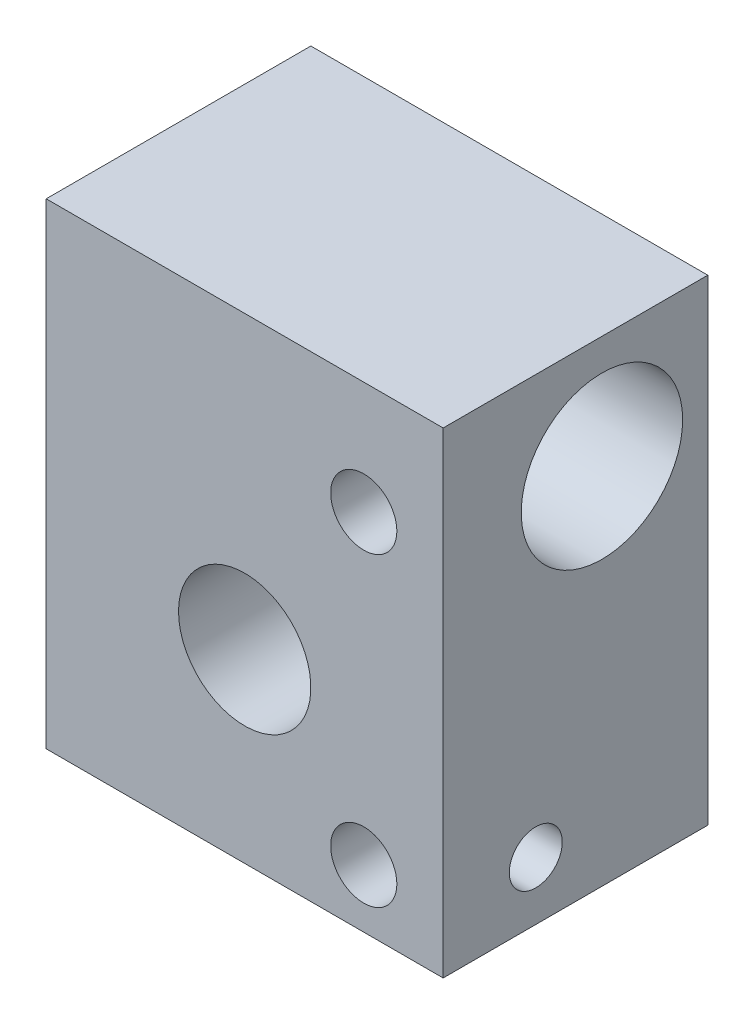
ISO-10303-21;
HEADER;
FILE_DESCRIPTION(('STEP AP214'),'2;1');
FILE_NAME('part.step','',(''),(''),'','','');
FILE_SCHEMA(('AUTOMOTIVE_DESIGN { 1 0 10303 214 1 1 1 1 }'));
ENDSEC;
DATA;
#1=APPLICATION_CONTEXT('core data for automotive mechanical design processes');
#2=APPLICATION_PROTOCOL_DEFINITION('international standard','automotive_design',2000,#1);
#3=PRODUCT_CONTEXT('',#1,'mechanical');
#4=PRODUCT('Part','Part','',(#3));
#5=PRODUCT_RELATED_PRODUCT_CATEGORY('part','',(#4));
#6=PRODUCT_DEFINITION_FORMATION('','',#4);
#7=PRODUCT_DEFINITION_CONTEXT('part definition',#1,'design');
#8=PRODUCT_DEFINITION('design','',#6,#7);
#9=PRODUCT_DEFINITION_SHAPE('','',#8);
#10=(LENGTH_UNIT() NAMED_UNIT(*) SI_UNIT(.MILLI.,.METRE.));
#11=(NAMED_UNIT(*) PLANE_ANGLE_UNIT() SI_UNIT($,.RADIAN.));
#12=(NAMED_UNIT(*) SI_UNIT($,.STERADIAN.) SOLID_ANGLE_UNIT());
#13=UNCERTAINTY_MEASURE_WITH_UNIT(LENGTH_MEASURE(1.E-05),#10,'distance_accuracy_value','');
#14=(GEOMETRIC_REPRESENTATION_CONTEXT(3) GLOBAL_UNCERTAINTY_ASSIGNED_CONTEXT((#13)) GLOBAL_UNIT_ASSIGNED_CONTEXT((#10,
#11,#12)) REPRESENTATION_CONTEXT('',''));
#15=CARTESIAN_POINT('',(0.,0.,0.));
#16=DIRECTION('',(0.,0.,1.));
#17=DIRECTION('',(1.,0.,0.));
#18=AXIS2_PLACEMENT_3D('',#15,#16,#17);
#19=CARTESIAN_POINT('',(7.5,-9.,10.));
#20=DIRECTION('',(-1.,0.,0.));
#21=DIRECTION('',(0.,0.,1.));
#22=AXIS2_PLACEMENT_3D('',#19,#20,#21);
#23=PLANE('',#22);
#24=CARTESIAN_POINT('',(7.5,-6.8,6.5));
#25=DIRECTION('',(1.,0.,0.));
#26=DIRECTION('',(0.,0.,-1.));
#27=AXIS2_PLACEMENT_3D('',#24,#25,#26);
#28=CIRCLE('',#27,0.999999999999998);
#29=CARTESIAN_POINT('',(7.5,-6.8,5.5));
#30=VERTEX_POINT('',#29);
#31=EDGE_CURVE('E108',#30,#30,#28,.T.);
#32=ORIENTED_EDGE('',*,*,#31,.F.);
#33=EDGE_LOOP('',(#32));
#34=FACE_BOUND('',#33,.T.);
#35=CARTESIAN_POINT('',(7.5,4.75,4.));
#36=DIRECTION('',(1.,0.,0.));
#37=DIRECTION('',(0.,0.,-1.));
#38=AXIS2_PLACEMENT_3D('',#35,#36,#37);
#39=CIRCLE('',#38,3.05);
#40=CARTESIAN_POINT('',(7.5,4.75,0.950000000000001));
#41=VERTEX_POINT('',#40);
#42=EDGE_CURVE('E229',#41,#41,#39,.T.);
#43=ORIENTED_EDGE('',*,*,#42,.F.);
#44=EDGE_LOOP('',(#43));
#45=FACE_BOUND('',#44,.T.);
#46=DIRECTION('',(0.,1.,0.));
#47=VECTOR('',#46,1.);
#48=CARTESIAN_POINT('',(7.5,-9.,0.));
#49=LINE('',#48,#47);
#50=CARTESIAN_POINT('',(7.5,-9.,0.));
#51=VERTEX_POINT('',#50);
#52=CARTESIAN_POINT('',(7.5,9.,0.));
#53=VERTEX_POINT('',#52);
#54=EDGE_CURVE('E190',#51,#53,#49,.T.);
#55=ORIENTED_EDGE('',*,*,#54,.T.);
#56=DIRECTION('',(0.,0.,-1.));
#57=VECTOR('',#56,1.);
#58=CARTESIAN_POINT('',(7.5,9.,10.));
#59=LINE('',#58,#57);
#60=CARTESIAN_POINT('',(7.5,9.,10.));
#61=VERTEX_POINT('',#60);
#62=EDGE_CURVE('E136',#61,#53,#59,.T.);
#63=ORIENTED_EDGE('',*,*,#62,.F.);
#64=DIRECTION('',(0.,1.,0.));
#65=VECTOR('',#64,1.);
#66=CARTESIAN_POINT('',(7.5,-9.,10.));
#67=LINE('',#66,#65);
#68=CARTESIAN_POINT('',(7.5,-9.,10.));
#69=VERTEX_POINT('',#68);
#70=EDGE_CURVE('E201',#69,#61,#67,.T.);
#71=ORIENTED_EDGE('',*,*,#70,.F.);
#72=DIRECTION('',(0.,0.,-1.));
#73=VECTOR('',#72,1.);
#74=CARTESIAN_POINT('',(7.5,-9.,10.));
#75=LINE('',#74,#73);
#76=EDGE_CURVE('E205',#69,#51,#75,.T.);
#77=ORIENTED_EDGE('',*,*,#76,.T.);
#78=EDGE_LOOP('',(#55,#63,#71,#77));
#79=FACE_BOUND('',#78,.T.);
#80=ADVANCED_FACE('F38',(#34,#45,#79),#23,.F.);
#81=CARTESIAN_POINT('',(-7.5,9.,10.));
#82=DIRECTION('',(0.,-1.,0.));
#83=DIRECTION('',(0.,0.,-1.));
#84=AXIS2_PLACEMENT_3D('',#81,#82,#83);
#85=PLANE('',#84);
#86=DIRECTION('',(-1.,0.,0.));
#87=VECTOR('',#86,1.);
#88=CARTESIAN_POINT('',(-7.5,9.,0.));
#89=LINE('',#88,#87);
#90=CARTESIAN_POINT('',(-7.5,9.,0.));
#91=VERTEX_POINT('',#90);
#92=EDGE_CURVE('E180',#53,#91,#89,.T.);
#93=ORIENTED_EDGE('',*,*,#92,.T.);
#94=DIRECTION('',(0.,0.,-1.));
#95=VECTOR('',#94,1.);
#96=CARTESIAN_POINT('',(-7.5,9.,10.));
#97=LINE('',#96,#95);
#98=CARTESIAN_POINT('',(-7.5,9.,10.));
#99=VERTEX_POINT('',#98);
#100=EDGE_CURVE('E182',#99,#91,#97,.T.);
#101=ORIENTED_EDGE('',*,*,#100,.F.);
#102=DIRECTION('',(-1.,0.,0.));
#103=VECTOR('',#102,1.);
#104=CARTESIAN_POINT('',(-7.5,9.,10.));
#105=LINE('',#104,#103);
#106=EDGE_CURVE('E215',#61,#99,#105,.T.);
#107=ORIENTED_EDGE('',*,*,#106,.F.);
#108=ORIENTED_EDGE('',*,*,#62,.T.);
#109=EDGE_LOOP('',(#93,#101,#107,#108));
#110=FACE_BOUND('',#109,.T.);
#111=ADVANCED_FACE('F170',(#110),#85,.F.);
#112=CARTESIAN_POINT('',(-7.5,-9.,10.));
#113=DIRECTION('',(1.,0.,0.));
#114=DIRECTION('',(0.,0.,-1.));
#115=AXIS2_PLACEMENT_3D('',#112,#113,#114);
#116=PLANE('',#115);
#117=CARTESIAN_POINT('',(-7.5,4.75,4.));
#118=DIRECTION('',(1.,0.,0.));
#119=DIRECTION('',(0.,0.,-1.));
#120=AXIS2_PLACEMENT_3D('',#117,#118,#119);
#121=CIRCLE('',#120,3.05);
#122=CARTESIAN_POINT('',(-7.5,4.75,0.950000000000001));
#123=VERTEX_POINT('',#122);
#124=EDGE_CURVE('E226',#123,#123,#121,.T.);
#125=ORIENTED_EDGE('',*,*,#124,.T.);
#126=EDGE_LOOP('',(#125));
#127=FACE_BOUND('',#126,.T.);
#128=DIRECTION('',(0.,-1.,0.));
#129=VECTOR('',#128,1.);
#130=CARTESIAN_POINT('',(-7.5,-9.,0.));
#131=LINE('',#130,#129);
#132=CARTESIAN_POINT('',(-7.5,-9.,0.));
#133=VERTEX_POINT('',#132);
#134=EDGE_CURVE('E189',#91,#133,#131,.T.);
#135=ORIENTED_EDGE('',*,*,#134,.T.);
#136=DIRECTION('',(0.,0.,-1.));
#137=VECTOR('',#136,1.);
#138=CARTESIAN_POINT('',(-7.5,-9.,10.));
#139=LINE('',#138,#137);
#140=CARTESIAN_POINT('',(-7.5,-9.,10.));
#141=VERTEX_POINT('',#140);
#142=EDGE_CURVE('E196',#141,#133,#139,.T.);
#143=ORIENTED_EDGE('',*,*,#142,.F.);
#144=DIRECTION('',(0.,-1.,0.));
#145=VECTOR('',#144,1.);
#146=CARTESIAN_POINT('',(-7.5,-9.,10.));
#147=LINE('',#146,#145);
#148=EDGE_CURVE('E195',#99,#141,#147,.T.);
#149=ORIENTED_EDGE('',*,*,#148,.F.);
#150=ORIENTED_EDGE('',*,*,#100,.T.);
#151=EDGE_LOOP('',(#135,#143,#149,#150));
#152=FACE_BOUND('',#151,.T.);
#153=ADVANCED_FACE('F167',(#127,#152),#116,.F.);
#154=CARTESIAN_POINT('',(-7.5,-9.,10.));
#155=DIRECTION('',(0.,1.,0.));
#156=DIRECTION('',(0.,0.,1.));
#157=AXIS2_PLACEMENT_3D('',#154,#155,#156);
#158=PLANE('',#157);
#159=DIRECTION('',(1.,0.,0.));
#160=VECTOR('',#159,1.);
#161=CARTESIAN_POINT('',(-7.5,-9.,0.));
#162=LINE('',#161,#160);
#163=EDGE_CURVE('E199',#133,#51,#162,.T.);
#164=ORIENTED_EDGE('',*,*,#163,.T.);
#165=ORIENTED_EDGE('',*,*,#76,.F.);
#166=DIRECTION('',(1.,0.,0.));
#167=VECTOR('',#166,1.);
#168=CARTESIAN_POINT('',(-7.5,-9.,10.));
#169=LINE('',#168,#167);
#170=EDGE_CURVE('E208',#141,#69,#169,.T.);
#171=ORIENTED_EDGE('',*,*,#170,.F.);
#172=ORIENTED_EDGE('',*,*,#142,.T.);
#173=EDGE_LOOP('',(#164,#165,#171,#172));
#174=FACE_BOUND('',#173,.T.);
#175=ADVANCED_FACE('F160',(#174),#158,.F.);
#176=CARTESIAN_POINT('',(0.,0.,10.));
#177=DIRECTION('',(0.,0.,-1.));
#178=DIRECTION('',(-1.,0.,0.));
#179=AXIS2_PLACEMENT_3D('',#176,#177,#178);
#180=PLANE('',#179);
#181=CARTESIAN_POINT('',(4.5,4.75,10.));
#182=DIRECTION('',(0.,0.,1.));
#183=DIRECTION('',(1.,0.,0.));
#184=AXIS2_PLACEMENT_3D('',#181,#182,#183);
#185=CIRCLE('',#184,1.24999999999999);
#186=CARTESIAN_POINT('',(5.74999999999999,4.75,10.));
#187=VERTEX_POINT('',#186);
#188=EDGE_CURVE('E241',#187,#187,#185,.T.);
#189=ORIENTED_EDGE('',*,*,#188,.F.);
#190=EDGE_LOOP('',(#189));
#191=FACE_BOUND('',#190,.T.);
#192=CARTESIAN_POINT('',(4.5,-6.8,10.));
#193=DIRECTION('',(0.,0.,1.));
#194=DIRECTION('',(1.,0.,0.));
#195=AXIS2_PLACEMENT_3D('',#192,#193,#194);
#196=CIRCLE('',#195,1.24999999999999);
#197=CARTESIAN_POINT('',(5.74999999999999,-6.8,10.));
#198=VERTEX_POINT('',#197);
#199=EDGE_CURVE('E239',#198,#198,#196,.T.);
#200=ORIENTED_EDGE('',*,*,#199,.F.);
#201=EDGE_LOOP('',(#200));
#202=FACE_BOUND('',#201,.T.);
#203=CARTESIAN_POINT('',(0.,-2.,10.));
#204=DIRECTION('',(0.,0.,-1.));
#205=DIRECTION('',(-1.,0.,0.));
#206=AXIS2_PLACEMENT_3D('',#203,#204,#205);
#207=CIRCLE('',#206,2.5);
#208=CARTESIAN_POINT('',(-2.5,-2.,10.));
#209=VERTEX_POINT('',#208);
#210=EDGE_CURVE('E218',#209,#209,#207,.T.);
#211=ORIENTED_EDGE('',*,*,#210,.T.);
#212=EDGE_LOOP('',(#211));
#213=FACE_BOUND('',#212,.T.);
#214=ORIENTED_EDGE('',*,*,#70,.T.);
#215=ORIENTED_EDGE('',*,*,#106,.T.);
#216=ORIENTED_EDGE('',*,*,#148,.T.);
#217=ORIENTED_EDGE('',*,*,#170,.T.);
#218=EDGE_LOOP('',(#214,#215,#216,#217));
#219=FACE_BOUND('',#218,.T.);
#220=ADVANCED_FACE('F157',(#191,#202,#213,#219),#180,.F.);
#221=CARTESIAN_POINT('',(0.,0.,0.));
#222=DIRECTION('',(0.,0.,-1.));
#223=DIRECTION('',(-1.,0.,0.));
#224=AXIS2_PLACEMENT_3D('',#221,#222,#223);
#225=PLANE('',#224);
#226=CARTESIAN_POINT('',(0.,-2.,0.));
#227=DIRECTION('',(0.,0.,-1.));
#228=DIRECTION('',(-1.,0.,0.));
#229=AXIS2_PLACEMENT_3D('',#226,#227,#228);
#230=CIRCLE('',#229,2.5);
#231=CARTESIAN_POINT('',(-2.5,-2.,0.));
#232=VERTEX_POINT('',#231);
#233=EDGE_CURVE('E221',#232,#232,#230,.T.);
#234=ORIENTED_EDGE('',*,*,#233,.F.);
#235=EDGE_LOOP('',(#234));
#236=FACE_BOUND('',#235,.T.);
#237=ORIENTED_EDGE('',*,*,#54,.F.);
#238=ORIENTED_EDGE('',*,*,#163,.F.);
#239=ORIENTED_EDGE('',*,*,#134,.F.);
#240=ORIENTED_EDGE('',*,*,#92,.F.);
#241=EDGE_LOOP('',(#237,#238,#239,#240));
#242=FACE_BOUND('',#241,.T.);
#243=ADVANCED_FACE('F155',(#236,#242),#225,.T.);
#244=CARTESIAN_POINT('',(0.,-2.,10.));
#245=DIRECTION('',(0.,0.,-1.));
#246=DIRECTION('',(-1.,0.,0.));
#247=AXIS2_PLACEMENT_3D('',#244,#245,#246);
#248=CYLINDRICAL_SURFACE('',#247,2.5);
#249=ORIENTED_EDGE('',*,*,#210,.F.);
#250=EDGE_LOOP('',(#249));
#251=FACE_BOUND('',#250,.T.);
#252=ORIENTED_EDGE('',*,*,#233,.T.);
#253=EDGE_LOOP('',(#252));
#254=FACE_BOUND('',#253,.T.);
#255=ADVANCED_FACE('F151',(#251,#254),#248,.F.);
#256=CARTESIAN_POINT('',(-7.5,4.75,4.));
#257=DIRECTION('',(1.,0.,0.));
#258=DIRECTION('',(0.,0.,-1.));
#259=AXIS2_PLACEMENT_3D('',#256,#257,#258);
#260=CYLINDRICAL_SURFACE('',#259,3.05);
#261=CARTESIAN_POINT('',(5.74999999999999,4.75,7.05));
#262=CARTESIAN_POINT('',(5.74999317358084,4.81705105449435,7.0499949013604));
#263=CARTESIAN_POINT('',(5.7445728904159,4.88421220939516,7.04776316601173));
#264=CARTESIAN_POINT('',(5.7230821427269,5.01663531512961,7.03905220749816));
#265=CARTESIAN_POINT('',(5.7069833965083,5.08189174087961,7.0325617055695));
#266=CARTESIAN_POINT('',(5.66482596800735,5.20837429284752,7.01603149034563));
#267=CARTESIAN_POINT('',(5.63880056530878,5.2696130929358,7.00600364451595));
#268=CARTESIAN_POINT('',(5.57766372514542,5.38679775394015,6.98337979201622));
#269=CARTESIAN_POINT('',(5.54255520538643,5.44274530666015,6.97078461030852));
#270=CARTESIAN_POINT('',(5.46243359833868,5.55058268229026,6.94360272183732));
#271=CARTESIAN_POINT('',(5.41704813784625,5.60217961883631,6.92895218720805));
#272=CARTESIAN_POINT('',(5.31844769395315,5.69727980579278,6.8995935820288));
#273=CARTESIAN_POINT('',(5.26522873562099,5.74077892161812,6.88488548598071));
#274=CARTESIAN_POINT('',(5.1494220879687,5.82047635819198,6.85630174305004));
#275=CARTESIAN_POINT('',(5.08651058665788,5.85623272255294,6.84249824263373));
#276=CARTESIAN_POINT('',(4.95491722684178,5.91652509902148,6.81829427065235));
#277=CARTESIAN_POINT('',(4.88623826542879,5.9410667050528,6.80789210323986));
#278=CARTESIAN_POINT('',(4.74842884283273,5.977033698322,6.79235707938262));
#279=CARTESIAN_POINT('',(4.67947149284317,5.98902161527503,6.78699943260884));
#280=CARTESIAN_POINT('',(4.54033187566907,6.00129693566521,6.78151145539133));
#281=CARTESIAN_POINT('',(4.47015027248522,6.00159049579919,6.78137837438494));
#282=CARTESIAN_POINT('',(4.33607409840986,5.99089353762405,6.78616368996563));
#283=CARTESIAN_POINT('',(4.27209740726591,5.98073314256808,6.79071047916049));
#284=CARTESIAN_POINT('',(4.14685271703793,5.95080567936669,6.80371701324258));
#285=CARTESIAN_POINT('',(4.08558521945647,5.93103684064336,6.81217747930138));
#286=CARTESIAN_POINT('',(3.96597856734735,5.88207159424284,6.83224715740189));
#287=CARTESIAN_POINT('',(3.90772757534972,5.85268647565431,6.84391858333761));
#288=CARTESIAN_POINT('',(3.79676189319712,5.78545581744839,6.8690795378448));
#289=CARTESIAN_POINT('',(3.74404935655718,5.7476070046597,6.88256976900067));
#290=CARTESIAN_POINT('',(3.64113506271575,5.66089979031177,6.91118669367846));
#291=CARTESIAN_POINT('',(3.59148817119212,5.61139546177047,6.92635714795841));
#292=CARTESIAN_POINT('',(3.50101833818234,5.50460843164101,6.95569448523891));
#293=CARTESIAN_POINT('',(3.46019733238115,5.44732402821036,6.96986114763168));
#294=CARTESIAN_POINT('',(3.38776019476994,5.32496342854657,6.99598214323011));
#295=CARTESIAN_POINT('',(3.35636271935724,5.25974527572702,7.00788187819974));
#296=CARTESIAN_POINT('',(3.30517803112997,5.12434088842293,7.02771185130719));
#297=CARTESIAN_POINT('',(3.28538461664024,5.05415733016857,7.03564420943661));
#298=CARTESIAN_POINT('',(3.25911499785756,4.91545720041041,7.04625363825052));
#299=CARTESIAN_POINT('',(3.25189372784432,4.84710415103708,7.04922426910946));
#300=CARTESIAN_POINT('',(3.24876092149755,4.71010441371817,7.0505074612745));
#301=CARTESIAN_POINT('',(3.25284627086616,4.64145781182913,7.04882130524732));
#302=CARTESIAN_POINT('',(3.27167121733155,4.50926209998629,7.04117156509262));
#303=CARTESIAN_POINT('',(3.28589367478943,4.44562598291882,7.03541570476584));
#304=CARTESIAN_POINT('',(3.32387605471634,4.32170816248345,7.02042451329165));
#305=CARTESIAN_POINT('',(3.34763719121059,4.26142688721188,7.01118873925112));
#306=CARTESIAN_POINT('',(3.40479928404273,4.14383011012163,6.98977295322551));
#307=CARTESIAN_POINT('',(3.43847544195124,4.08666382302296,6.97751077732146));
#308=CARTESIAN_POINT('',(3.51420811639302,3.97859041874229,6.95135965585715));
#309=CARTESIAN_POINT('',(3.55626807827196,3.92768588879936,6.93747004246777));
#310=CARTESIAN_POINT('',(3.65098440399942,3.82987991098666,6.9083776173988));
#311=CARTESIAN_POINT('',(3.70417275944046,3.78349954211682,6.89315046142814));
#312=CARTESIAN_POINT('',(3.81783195761042,3.70018452435906,6.86397295744693));
#313=CARTESIAN_POINT('',(3.87830425548019,3.66325176747518,6.85002286554325));
#314=CARTESIAN_POINT('',(4.00591935720062,3.59955272757804,6.82491824303052));
#315=CARTESIAN_POINT('',(4.0731350035576,3.57291696039833,6.8138001745101));
#316=CARTESIAN_POINT('',(4.21169404128461,3.53156002386075,6.79614362783963));
#317=CARTESIAN_POINT('',(4.28303413036749,3.51682946022231,6.78960153937764));
#318=CARTESIAN_POINT('',(4.42205571719578,3.50061997017984,6.78237686582237));
#319=CARTESIAN_POINT('',(4.48961071540186,3.49823064874135,6.78129189039514));
#320=CARTESIAN_POINT('',(4.62411541510115,3.50435741732201,6.78404131006805));
#321=CARTESIAN_POINT('',(4.6910652011546,3.51287195937366,6.7878750068888));
#322=CARTESIAN_POINT('',(4.8194595845332,3.53980857539514,6.79966724973414));
#323=CARTESIAN_POINT('',(4.88101694579431,3.55778270632242,6.80743875303861));
#324=CARTESIAN_POINT('',(5.00026093044537,3.60269826055876,6.82609039777681));
#325=CARTESIAN_POINT('',(5.0579464682445,3.62964218632339,6.83697140660187));
#326=CARTESIAN_POINT('',(5.17152052867124,3.69356546820026,6.86141244323642));
#327=CARTESIAN_POINT('',(5.22710231558399,3.73104304994741,6.87509264152988));
#328=CARTESIAN_POINT('',(5.33147333634056,3.81425954659735,6.90324259102355));
#329=CARTESIAN_POINT('',(5.38026033074679,3.8600011738197,6.91771260035406));
#330=CARTESIAN_POINT('',(5.47314082024466,3.96222488066987,6.94701985281455));
#331=CARTESIAN_POINT('',(5.51667265144533,4.0192324065468,6.961812751821));
#332=CARTESIAN_POINT('',(5.59357367951555,4.14029737005191,6.98908126299053));
#333=CARTESIAN_POINT('',(5.6269382146159,4.20435802331352,7.00155581115557));
#334=CARTESIAN_POINT('',(5.68180811191665,4.33663629870453,7.02258806460315));
#335=CARTESIAN_POINT('',(5.70351052450805,4.40476171520484,7.03121040731175));
#336=CARTESIAN_POINT('',(5.73495872650017,4.54399616753341,7.04383134859934));
#337=CARTESIAN_POINT('',(5.74474216568277,4.61509507070934,7.04784450441534));
#338=CARTESIAN_POINT('',(5.74946289651355,4.70760124338892,7.04978053015449));
#339=CARTESIAN_POINT('',(5.75000215885384,4.72879511590617,7.05000161244387));
#340=CARTESIAN_POINT('',(5.74999999999999,4.75,7.05));
#341=B_SPLINE_CURVE_WITH_KNOTS('',3,(#261,#262,#263,#264,#265,#266,#267,#268,#269,#270,#271,
#272,#273,#274,#275,#276,#277,#278,#279,#280,#281,#282,#283,#284,#285,#286,#287,#288,#289,#290,
#291,#292,#293,#294,#295,#296,#297,#298,#299,#300,#301,#302,#303,#304,#305,#306,#307,#308,#309,
#310,#311,#312,#313,#314,#315,#316,#317,#318,#319,#320,#321,#322,#323,#324,#325,#326,#327,#328,
#329,#330,#331,#332,#333,#334,#335,#336,#337,#338,#339,#340),.UNSPECIFIED.,.T.,.F.,(4,2,2,2,2,2,
2,2,2,2,2,2,2,2,2,2,2,2,2,2,2,2,2,2,2,2,2,2,2,2,2,2,2,2,2,2,2,2,2,4),(0.,0.201094311180327,
0.402723354574274,0.60368228554281,0.804576743863707,1.01444492091329,1.22441996030868,
1.44431409976959,1.66409843594336,1.87354721803841,2.08288573073389,2.27679448285735,
2.47073898070664,2.66874390795883,2.86682554265503,3.08105274490332,3.29532688370776,
3.51424468844056,3.73304538781654,3.93837132545348,4.14364071369572,4.33912550528581,
4.53463518488672,4.73618655641969,4.93782092740471,5.15341391236424,5.36905003881043,
5.58733616568886,5.80544987646513,6.00721727204662,6.20895602688514,6.40190297186301,
6.59490379169176,6.79928960640031,7.00374262427848,7.22240178249367,7.44116104698124,
7.65609749208749,7.87035321839582,7.93394925864703),.UNSPECIFIED.);
#342=CARTESIAN_POINT('',(5.74999999999999,4.75,7.05));
#343=VERTEX_POINT('',#342);
#344=EDGE_CURVE('E137',#343,#343,#341,.T.);
#345=ORIENTED_EDGE('',*,*,#344,.T.);
#346=EDGE_LOOP('',(#345));
#347=FACE_BOUND('',#346,.T.);
#348=ORIENTED_EDGE('',*,*,#124,.F.);
#349=EDGE_LOOP('',(#348));
#350=FACE_BOUND('',#349,.T.);
#351=ORIENTED_EDGE('',*,*,#42,.T.);
#352=EDGE_LOOP('',(#351));
#353=FACE_BOUND('',#352,.T.);
#354=ADVANCED_FACE('F145',(#347,#350,#353),#260,.F.);
#355=CARTESIAN_POINT('',(4.5,-6.8,6.));
#356=DIRECTION('',(0.,0.,1.));
#357=DIRECTION('',(1.,0.,0.));
#358=AXIS2_PLACEMENT_3D('',#355,#356,#357);
#359=CONICAL_SURFACE('',#358,1.25,1.02974425867665);
#360=CARTESIAN_POINT('',(4.5,-6.8,5.24892422621555));
#361=VERTEX_POINT('',#360);
#362=VERTEX_LOOP('',#361);
#363=FACE_BOUND('',#362,.T.);
#364=CARTESIAN_POINT('',(4.5,-6.8,6.));
#365=DIRECTION('',(0.,0.,1.));
#366=DIRECTION('',(1.,0.,0.));
#367=AXIS2_PLACEMENT_3D('',#364,#365,#366);
#368=CIRCLE('',#367,1.25);
#369=CARTESIAN_POINT('',(3.598612181134,-7.66602540378443,6.));
#370=VERTEX_POINT('',#369);
#371=CARTESIAN_POINT('',(5.40138781886869,-7.66602540378681,6.00000000000196));
#372=VERTEX_POINT('',#371);
#373=EDGE_CURVE('E238',#370,#372,#368,.T.);
#374=ORIENTED_EDGE('',*,*,#373,.T.);
#375=CARTESIAN_POINT('',(5.49028641707355,-7.69312930754734,6.0502));
#376=CARTESIAN_POINT('',(5.4620540291597,-7.68516229364402,6.03439446403427));
#377=CARTESIAN_POINT('',(5.43397441822092,-7.67667040293627,6.01856440625544));
#378=CARTESIAN_POINT('',(5.37820933805071,-7.65846567832842,5.98679857880335));
#379=CARTESIAN_POINT('',(5.35052460000254,-7.64875084220868,5.97086267732073));
#380=CARTESIAN_POINT('',(5.29534164443274,-7.62780610981277,5.93865263805377));
#381=CARTESIAN_POINT('',(5.26785172041543,-7.6165565790724,5.92237691803523));
#382=CARTESIAN_POINT('',(5.21372068820972,-7.59240944996764,5.88967177107602));
#383=CARTESIAN_POINT('',(5.18707899740181,-7.5795130147024,5.87324246012328));
#384=CARTESIAN_POINT('',(5.13220243909832,-7.55021227801001,5.83836852135706));
#385=CARTESIAN_POINT('',(5.10410431543777,-7.53357989189848,5.8198971567474));
#386=CARTESIAN_POINT('',(5.05034517125699,-7.49710879666876,5.78255861572174));
#387=CARTESIAN_POINT('',(5.02467984624535,-7.47727592504741,5.76369221334503));
#388=CARTESIAN_POINT('',(4.98483989175455,-7.43999201796968,5.73135380836441));
#389=CARTESIAN_POINT('',(4.96954941989286,-7.4236625107789,5.71799347162254));
#390=CARTESIAN_POINT('',(4.94218478884379,-7.38857975994309,5.6912618305678));
#391=CARTESIAN_POINT('',(4.93009685493828,-7.36983742938766,5.67789082979815));
#392=CARTESIAN_POINT('',(4.91016740799821,-7.329590146974,5.65140304199133));
#393=CARTESIAN_POINT('',(4.90238168548031,-7.3080531773224,5.63829162851512));
#394=CARTESIAN_POINT('',(4.89169708291768,-7.26309379111954,5.61331666161574));
#395=CARTESIAN_POINT('',(4.88881009238113,-7.23966693149489,5.60145620952708));
#396=CARTESIAN_POINT('',(4.88623771053257,-7.18102854252964,5.57464593497841));
#397=CARTESIAN_POINT('',(4.8886037228914,-7.14530002689939,5.56074189203022));
#398=CARTESIAN_POINT('',(4.89581292295022,-7.07266926803107,5.53712400838137));
#399=CARTESIAN_POINT('',(4.90066989969421,-7.03576157518701,5.52743405299092));
#400=CARTESIAN_POINT('',(4.91006860539325,-6.95380542606474,5.51086100553405));
#401=CARTESIAN_POINT('',(4.91437678220478,-6.90853802728334,5.50485597158092));
#402=CARTESIAN_POINT('',(4.9184748067492,-6.81754799344687,5.49912238604378));
#403=CARTESIAN_POINT('',(4.91828328292789,-6.77182801826922,5.49936795774198));
#404=CARTESIAN_POINT('',(4.91341881342609,-6.67863261058294,5.50622854677725));
#405=CARTESIAN_POINT('',(4.90849830019974,-6.63120016203335,5.51319551359828));
#406=CARTESIAN_POINT('',(4.8974167784806,-6.53776947303589,5.53380349357297));
#407=CARTESIAN_POINT('',(4.89125185371857,-6.4917763035517,5.54746577626934));
#408=CARTESIAN_POINT('',(4.88715963497418,-6.42244524242514,5.57365031385066));
#409=CARTESIAN_POINT('',(4.88674774685179,-6.39841640858867,5.58380701297793));
#410=CARTESIAN_POINT('',(4.88976593975288,-6.3515349652331,5.60582909571334));
#411=CARTESIAN_POINT('',(4.89316735273016,-6.32867491195563,5.61768115280812));
#412=CARTESIAN_POINT('',(4.90481955461782,-6.28460383870021,5.642669092288));
#413=CARTESIAN_POINT('',(4.91312257269359,-6.26341340810177,5.65581751190304));
#414=CARTESIAN_POINT('',(4.93411194219538,-6.22351706477168,5.68253382279197));
#415=CARTESIAN_POINT('',(4.94682115498955,-6.20482482880032,5.69610355897556));
#416=CARTESIAN_POINT('',(4.98149614630583,-6.16232995685965,5.72903491275924));
#417=CARTESIAN_POINT('',(5.00508221426013,-6.13985006830772,5.74834355388397));
#418=CARTESIAN_POINT('',(5.05581374943648,-6.09868488061901,5.78659230699454));
#419=CARTESIAN_POINT('',(5.08298397356535,-6.08002851866166,5.80552869364956));
#420=CARTESIAN_POINT('',(5.14072146790836,-6.04479770679221,5.84396632214518));
#421=CARTESIAN_POINT('',(5.1713904277386,-6.02837263772575,5.86344892060987));
#422=CARTESIAN_POINT('',(5.23412643971758,-5.99799989181846,5.90217002760717));
#423=CARTESIAN_POINT('',(5.26619554023356,-5.98405600718381,5.92140812147574));
#424=CARTESIAN_POINT('',(5.3300143351173,-5.95868810757523,5.95899211536545));
#425=CARTESIAN_POINT('',(5.36173093611331,-5.94718922450714,5.97734442596747));
#426=CARTESIAN_POINT('',(5.4256642289682,-5.92585951930255,6.0138744249624));
#427=CARTESIAN_POINT('',(5.45787881496915,-5.91602307251018,6.03205249756596));
#428=CARTESIAN_POINT('',(5.49028641707356,-5.90687069245265,6.05019999999999));
#429=B_SPLINE_CURVE_WITH_KNOTS('',3,(#375,#376,#377,#378,#379,#380,#381,#382,#383,#384,#385,
#386,#387,#388,#389,#390,#391,#392,#393,#394,#395,#396,#397,#398,#399,#400,#401,#402,#403,#404,
#405,#406,#407,#408,#409,#410,#411,#412,#413,#414,#415,#416,#417,#418,#419,#420,#421,#422,#423,
#424,#425,#426,#427,#428),.UNSPECIFIED.,.F.,.F.,(4,2,2,2,2,2,2,2,2,2,2,2,2,2,2,2,2,2,2,2,2,2,2,
2,2,2,4),(0.,0.0999728954722889,0.200111649914622,0.301678803220385,0.403174619034599,
0.515584481665867,0.627791585764168,0.705740491157839,0.783348470749543,0.861940559971286,
0.940723125374583,1.05531115599276,1.17054046158092,1.30757349647233,1.44403932453253,
1.58806182841255,1.73254485532535,1.81057795926005,1.88802832841069,1.96631925883886,
2.04502263303189,2.15802352730949,2.27185038942399,2.39132944073084,2.51098956226303,
2.62616392516715,2.74094044998118),.UNSPECIFIED.);
#430=CARTESIAN_POINT('',(5.401387818866,-5.93397459621556,6.));
#431=VERTEX_POINT('',#430);
#432=EDGE_CURVE('E11',#372,#431,#429,.T.);
#433=ORIENTED_EDGE('',*,*,#432,.T.);
#434=CARTESIAN_POINT('',(3.59861218113131,-5.93397459621319,6.00000000000196));
#435=VERTEX_POINT('',#434);
#436=EDGE_CURVE('E233',#431,#435,#368,.T.);
#437=ORIENTED_EDGE('',*,*,#436,.T.);
#438=CARTESIAN_POINT('',(3.50971358292644,-5.90687069245266,6.0502));
#439=CARTESIAN_POINT('',(3.53331315066842,-5.91352483721161,6.03699153619936));
#440=CARTESIAN_POINT('',(3.5567997123455,-5.92055093156863,6.02376501618166));
#441=CARTESIAN_POINT('',(3.60349741941,-5.9354342598509,5.99724961432135));
#442=CARTESIAN_POINT('',(3.62670833949662,-5.943292127758,5.98396069239589));
#443=CARTESIAN_POINT('',(3.69717031261121,-5.96872321181211,5.94319816564678));
#444=CARTESIAN_POINT('',(3.7438358110887,-5.98776882275197,5.91561372999426));
#445=CARTESIAN_POINT('',(3.83471240297246,-6.03095640395233,5.85981688611285));
#446=CARTESIAN_POINT('',(3.87891676344681,-6.05511156272037,5.83160302516138));
#447=CARTESIAN_POINT('',(3.94083716089381,-6.09681482391588,5.78872178686289));
#448=CARTESIAN_POINT('',(3.96066329263914,-6.11154589536983,5.77440315102412));
#449=CARTESIAN_POINT('',(3.99813510882635,-6.14332035661841,5.74552415052808));
#450=CARTESIAN_POINT('',(4.01578567575378,-6.16035838166081,5.73096441352294));
#451=CARTESIAN_POINT('',(4.04652590778618,-6.19591099573206,5.70278607647913));
#452=CARTESIAN_POINT('',(4.05985910623184,-6.21421741426561,5.68917928098483));
#453=CARTESIAN_POINT('',(4.08226510274055,-6.2533626627292,5.66229859506211));
#454=CARTESIAN_POINT('',(4.09136422741643,-6.27418480156528,5.64902314678261));
#455=CARTESIAN_POINT('',(4.10464310673414,-6.31793974424823,5.62349687802884));
#456=CARTESIAN_POINT('',(4.10881781004169,-6.34087468940767,5.61124712162209));
#457=CARTESIAN_POINT('',(4.11306265600131,-6.38806657508964,5.58840380415463));
#458=CARTESIAN_POINT('',(4.11309881514464,-6.41233282411698,5.57782466777655));
#459=CARTESIAN_POINT('',(4.11081909538787,-6.46046097284519,5.55906713984957));
#460=CARTESIAN_POINT('',(4.10859993826292,-6.48429842321439,5.55080787372999));
#461=CARTESIAN_POINT('',(4.10335614543742,-6.53246306784323,5.5361231670742));
#462=CARTESIAN_POINT('',(4.1003306042383,-6.55679078406327,5.52969980500596));
#463=CARTESIAN_POINT('',(4.09451085196856,-6.60579562257214,5.51871894904032));
#464=CARTESIAN_POINT('',(4.09171580951763,-6.63047107603481,5.51415449234926));
#465=CARTESIAN_POINT('',(4.08702679450586,-6.68017771334998,5.50688722680716));
#466=CARTESIAN_POINT('',(4.08513254220297,-6.70520878427462,5.50418383988055));
#467=CARTESIAN_POINT('',(4.08254750308201,-6.75738125016416,5.5005412204046));
#468=CARTESIAN_POINT('',(4.08195889631627,-6.78453870485979,5.49975135089749));
#469=CARTESIAN_POINT('',(4.08241996599582,-6.83881884917334,5.50038504756375));
#470=CARTESIAN_POINT('',(4.08347004507912,-6.86594152860778,5.50180915772903));
#471=CARTESIAN_POINT('',(4.08697842937304,-6.92002793067094,5.5068557657891));
#472=CARTESIAN_POINT('',(4.0894441853843,-6.94699004361226,5.51048990123161));
#473=CARTESIAN_POINT('',(4.09516019310819,-7.00043858924834,5.51991792137252));
#474=CARTESIAN_POINT('',(4.09841040229522,-7.02692504764496,5.52571168900542));
#475=CARTESIAN_POINT('',(4.10519576081253,-7.08368196745147,5.54056108147484));
#476=CARTESIAN_POINT('',(4.10868992530325,-7.11385875777519,5.54999633842318));
#477=CARTESIAN_POINT('',(4.11285630884389,-7.17325822177271,5.57174106146463));
#478=CARTESIAN_POINT('',(4.11354654398704,-7.20248578590847,5.58403163962699));
#479=CARTESIAN_POINT('',(4.1096980334543,-7.25174952014176,5.60755661353824));
#480=CARTESIAN_POINT('',(4.10650824550244,-7.2721535088778,5.61819452914818));
#481=CARTESIAN_POINT('',(4.09631900767154,-7.31145889668883,5.64039608881511));
#482=CARTESIAN_POINT('',(4.08932129327637,-7.33036097577355,5.65195930911316));
#483=CARTESIAN_POINT('',(4.07187333548009,-7.36609999506259,5.67538611754454));
#484=CARTESIAN_POINT('',(4.06143983303491,-7.3829464164912,5.6872479966086));
#485=CARTESIAN_POINT('',(4.0379304302771,-7.41469361637308,5.71098474345566));
#486=CARTESIAN_POINT('',(4.02484833016169,-7.42958969221195,5.72285957546288));
#487=CARTESIAN_POINT('',(3.98245149583499,-7.47213854501448,5.75863019433972));
#488=CARTESIAN_POINT('',(3.95030629956501,-7.49711016597753,5.78229754158439));
#489=CARTESIAN_POINT('',(3.88231649195085,-7.54225642438731,5.82909749644401));
#490=CARTESIAN_POINT('',(3.84644852850505,-7.5623977869094,5.85222545652559));
#491=CARTESIAN_POINT('',(3.76145323607756,-7.60471990904869,5.90510677052084));
#492=CARTESIAN_POINT('',(3.71162145890342,-7.62564542244421,5.93472675232658));
#493=CARTESIAN_POINT('',(3.636071292196,-7.65346919608147,5.97858123510041));
#494=CARTESIAN_POINT('',(3.61102171575906,-7.66207715135555,5.9929551794052));
#495=CARTESIAN_POINT('',(3.56059863176369,-7.67831041892385,6.02162556712644));
#496=CARTESIAN_POINT('',(3.53522548724744,-7.68593674144481,6.03592207547788));
#497=CARTESIAN_POINT('',(3.50971358292644,-7.69312930754734,6.0502));
#498=B_SPLINE_CURVE_WITH_KNOTS('',3,(#438,#439,#440,#441,#442,#443,#444,#445,#446,#447,#448,
#449,#450,#451,#452,#453,#454,#455,#456,#457,#458,#459,#460,#461,#462,#463,#464,#465,#466,#467,
#468,#469,#470,#471,#472,#473,#474,#475,#476,#477,#478,#479,#480,#481,#482,#483,#484,#485,#486,
#487,#488,#489,#490,#491,#492,#493,#494,#495,#496,#497),.UNSPECIFIED.,.F.,.F.,(4,2,2,2,2,2,2,2,
2,2,2,2,2,2,2,2,2,2,2,2,2,2,2,2,2,2,2,2,2,4),(0.,0.0835520453506485,0.167168239405998,
0.339378728614747,0.512039264477075,0.597570075986015,0.682905298970882,0.761806801456588,
0.840210929777046,0.918695413123635,0.997824323169111,1.07369719179067,1.14965562058719,
1.22532686000053,1.30097458419883,1.38236014465604,1.46376570533486,1.54560368850048,
1.62743723618381,1.72272259273378,1.81739473431565,1.88674994840292,1.95607357990292,
2.02506430849321,2.09421843665384,2.23466803413924,2.37605903144819,2.5606240898532,
2.65102370647571,2.74132953346726),.UNSPECIFIED.);
#499=EDGE_CURVE('E50',#435,#370,#498,.T.);
#500=ORIENTED_EDGE('',*,*,#499,.T.);
#501=EDGE_LOOP('',(#374,#433,#437,#500));
#502=FACE_BOUND('',#501,.T.);
#503=ADVANCED_FACE('F142',(#363,#502),#359,.F.);
#504=CARTESIAN_POINT('',(4.5,-6.8,10.));
#505=DIRECTION('',(0.,0.,1.));
#506=DIRECTION('',(1.,0.,0.));
#507=AXIS2_PLACEMENT_3D('',#504,#505,#506);
#508=CYLINDRICAL_SURFACE('',#507,1.24999999999999);
#509=ORIENTED_EDGE('',*,*,#373,.F.);
#510=CARTESIAN_POINT('',(3.59861218113401,-7.66602540378443,6.));
#511=CARTESIAN_POINT('',(3.6184739762057,-7.68675902626416,6.03596487697014));
#512=CARTESIAN_POINT('',(3.63792426677372,-7.70550837472696,6.07356604043001));
#513=CARTESIAN_POINT('',(3.67420457060918,-7.73869615813151,6.15254086986226));
#514=CARTESIAN_POINT('',(3.69099237800154,-7.75306795614247,6.19396143451628));
#515=CARTESIAN_POINT('',(3.71662484017291,-7.774191046944,6.27147824029317));
#516=CARTESIAN_POINT('',(3.72638490183204,-7.78188898138144,6.30699782754954));
#517=CARTESIAN_POINT('',(3.74119250823732,-7.79337834014281,6.37944342339025));
#518=CARTESIAN_POINT('',(3.74626821333322,-7.7971931227873,6.41635962027606));
#519=CARTESIAN_POINT('',(3.75087623406768,-7.80066203387391,6.49104013185147));
#520=CARTESIAN_POINT('',(3.7503659702569,-7.80028420352463,6.52880876791995));
#521=CARTESIAN_POINT('',(3.74379868009988,-7.79532595045897,6.60363042555023));
#522=CARTESIAN_POINT('',(3.73772850144248,-7.79073556263663,6.64068153745415));
#523=CARTESIAN_POINT('',(3.71917407194171,-7.7762048970141,6.72156369670487));
#524=CARTESIAN_POINT('',(3.70551473903188,-7.7652582085766,6.76493288121588));
#525=CARTESIAN_POINT('',(3.67391866748519,-7.7383604281203,6.84844802500106));
#526=CARTESIAN_POINT('',(3.65597022712357,-7.72239560717476,6.88858475769217));
#527=CARTESIAN_POINT('',(3.60917119928421,-7.67771680229838,6.98318071024624));
#528=CARTESIAN_POINT('',(3.57907694975281,-7.64650740694967,7.03584310834097));
#529=CARTESIAN_POINT('',(3.5183559128812,-7.57529354321466,7.13452506969512));
#530=CARTESIAN_POINT('',(3.4877285307973,-7.53527858397908,7.18053659992188));
#531=CARTESIAN_POINT('',(3.42850448445096,-7.44599465399415,7.26586751507779));
#532=CARTESIAN_POINT('',(3.39994062620079,-7.3966085923144,7.30508869960434));
#533=CARTESIAN_POINT('',(3.34824880857564,-7.28936992436963,7.37439063704452));
#534=CARTESIAN_POINT('',(3.32510309630992,-7.23154600583372,7.40450133866137));
#535=CARTESIAN_POINT('',(3.29321706824316,-7.1287352289244,7.4454787311362));
#536=CARTESIAN_POINT('',(3.28223911477027,-7.08565789198627,7.45941959553146));
#537=CARTESIAN_POINT('',(3.2648228483799,-6.99714123564449,7.48143202454589));
#538=CARTESIAN_POINT('',(3.25838106982787,-6.95170374795623,7.48950807003057));
#539=CARTESIAN_POINT('',(3.25055997532031,-6.85954328009454,7.49930431849854));
#540=CARTESIAN_POINT('',(3.24919867951823,-6.81281631522798,7.50100189760592));
#541=CARTESIAN_POINT('',(3.25171166139105,-6.7197235050632,7.49786005964921));
#542=CARTESIAN_POINT('',(3.25558637936792,-6.67335769046427,7.49302009283597));
#543=CARTESIAN_POINT('',(3.26789644071195,-6.58478275906894,7.47754770761949));
#544=CARTESIAN_POINT('',(3.27608478095272,-6.54248278388333,7.46722878915105));
#545=CARTESIAN_POINT('',(3.29626920480038,-6.46041183970799,7.44155751906085));
#546=CARTESIAN_POINT('',(3.30826626745011,-6.42064152413306,7.42620387321483));
#547=CARTESIAN_POINT('',(3.33662734477677,-6.34061610275749,7.38943026475194));
#548=CARTESIAN_POINT('',(3.3532975400543,-6.30067249548245,7.36757318159561));
#549=CARTESIAN_POINT('',(3.38933145605348,-6.22495505790292,7.3193541579962));
#550=CARTESIAN_POINT('',(3.40869664925647,-6.18918352689241,7.29298975305069));
#551=CARTESIAN_POINT('',(3.45329012101718,-6.11506815716582,7.23053201378272));
#552=CARTESIAN_POINT('',(3.47890562257895,-6.07770544720324,7.1935526776411));
#553=CARTESIAN_POINT('',(3.53087218655124,-6.00934523514016,7.11449333600249));
#554=CARTESIAN_POINT('',(3.55722412508303,-5.97835571614283,7.07240703709845));
#555=CARTESIAN_POINT('',(3.60622712533196,-5.92544257606388,6.98727271180081));
#556=CARTESIAN_POINT('',(3.62899882820422,-5.90295754665743,6.94464367185246));
#557=CARTESIAN_POINT('',(3.67109389715927,-5.8639261797273,6.85515927976932));
#558=CARTESIAN_POINT('',(3.69042463040289,-5.84736707594537,6.80831328827332));
#559=CARTESIAN_POINT('',(3.7174904197567,-5.82512107880842,6.72548456791253));
#560=CARTESIAN_POINT('',(3.72696373236152,-5.81765791883793,6.69056171066615));
#561=CARTESIAN_POINT('',(3.7413777054509,-5.8064822586224,6.61924143143012));
#562=CARTESIAN_POINT('',(3.74632904724294,-5.80276091774684,6.582847697442));
#563=CARTESIAN_POINT('',(3.75084288272906,-5.79936325574491,6.50930543577151));
#564=CARTESIAN_POINT('',(3.75037402404743,-5.79971046874484,6.47215375882194));
#565=CARTESIAN_POINT('',(3.74406332067189,-5.80447363749868,6.39854452415325));
#566=CARTESIAN_POINT('',(3.73821204583665,-5.80889673433741,6.36208829934772));
#567=CARTESIAN_POINT('',(3.72015556167346,-5.82301417908606,6.28195047407756));
#568=CARTESIAN_POINT('',(3.70672784794526,-5.8337496511886,6.23874016297881));
#569=CARTESIAN_POINT('',(3.67558075675762,-5.86018777468765,6.15551608471109));
#570=CARTESIAN_POINT('',(3.65785350214665,-5.8758995594923,6.11550836600477));
#571=CARTESIAN_POINT('',(3.63248719620555,-5.89999800647273,6.06386935451384));
#572=CARTESIAN_POINT('',(3.62583601244268,-5.90645176298938,6.05079789602502));
#573=CARTESIAN_POINT('',(3.61235217206512,-5.91984613798792,6.02509125056285));
#574=CARTESIAN_POINT('',(3.6055204429112,-5.92678448884926,6.01245439677277));
#575=CARTESIAN_POINT('',(3.59861218113401,-5.93397459621556,6.));
#576=B_SPLINE_CURVE_WITH_KNOTS('',3,(#510,#511,#512,#513,#514,#515,#516,#517,#518,#519,#520,
#521,#522,#523,#524,#525,#526,#527,#528,#529,#530,#531,#532,#533,#534,#535,#536,#537,#538,#539,
#540,#541,#542,#543,#544,#545,#546,#547,#548,#549,#550,#551,#552,#553,#554,#555,#556,#557,#558,
#559,#560,#561,#562,#563,#564,#565,#566,#567,#568,#569,#570,#571,#572,#573,#574,#575),
.UNSPECIFIED.,.F.,.F.,(4,2,2,2,2,2,2,2,2,2,2,2,2,2,2,2,2,2,2,2,2,2,2,2,2,2,2,2,2,2,2,2,4),(0.,
0.138324485219001,0.278659992494998,0.391120375656937,0.50290020545926,0.615532674653408,
0.728432272744358,0.867958547262058,1.00786991882282,1.21146771466608,1.41530940067452,
1.62188934968772,1.82778264410881,1.96697817064107,2.1060672361662,2.2456491755503,
2.38524285325821,2.51759528452563,2.64998176494265,2.79491921961058,2.93993617777605,
3.1147433261769,3.28976812318018,3.44921515162318,3.60831658464993,3.71875479991453,
3.82893147021578,3.9397457590951,4.05075456820898,4.18950669098158,4.32851496646567,
4.37657658765977,4.4244266950054),.UNSPECIFIED.);
#577=EDGE_CURVE('E56',#370,#435,#576,.T.);
#578=ORIENTED_EDGE('',*,*,#577,.T.);
#579=ORIENTED_EDGE('',*,*,#436,.F.);
#580=CARTESIAN_POINT('',(5.40138781886599,-5.93397459621556,6.));
#581=CARTESIAN_POINT('',(5.38152602379429,-5.91324097373584,6.03596487697014));
#582=CARTESIAN_POINT('',(5.36207573322628,-5.89449162527303,6.07356604043001));
#583=CARTESIAN_POINT('',(5.32579542939081,-5.86130384186849,6.15254086986226));
#584=CARTESIAN_POINT('',(5.30900762199845,-5.84693204385752,6.19396143451628));
#585=CARTESIAN_POINT('',(5.28337515982709,-5.825808953056,6.27147824029317));
#586=CARTESIAN_POINT('',(5.27361509816796,-5.81811101861856,6.30699782754954));
#587=CARTESIAN_POINT('',(5.25880749176268,-5.80662165985719,6.37944342339025));
#588=CARTESIAN_POINT('',(5.25373178666677,-5.80280687721269,6.41635962027606));
#589=CARTESIAN_POINT('',(5.24912376593232,-5.79933796612609,6.49104013185147));
#590=CARTESIAN_POINT('',(5.2496340297431,-5.79971579647536,6.52880876791995));
#591=CARTESIAN_POINT('',(5.25620131990012,-5.80467404954102,6.60363042555023));
#592=CARTESIAN_POINT('',(5.26227149855751,-5.80926443736337,6.64068153745415));
#593=CARTESIAN_POINT('',(5.28082592805829,-5.8237951029859,6.72156369670487));
#594=CARTESIAN_POINT('',(5.29448526096812,-5.83474179142339,6.76493288121588));
#595=CARTESIAN_POINT('',(5.32608133251481,-5.86163957187969,6.84844802500106));
#596=CARTESIAN_POINT('',(5.34402977287642,-5.87760439282524,6.88858475769218));
#597=CARTESIAN_POINT('',(5.39082880071579,-5.92228319770162,6.98318071024624));
#598=CARTESIAN_POINT('',(5.42092305024719,-5.95349259305033,7.03584310834097));
#599=CARTESIAN_POINT('',(5.4816440871188,-6.02470645678534,7.13452506969512));
#600=CARTESIAN_POINT('',(5.51227146920269,-6.06472141602091,7.18053659992188));
#601=CARTESIAN_POINT('',(5.57149551554904,-6.15400534600585,7.26586751507779));
#602=CARTESIAN_POINT('',(5.60005937379921,-6.2033914076856,7.30508869960434));
#603=CARTESIAN_POINT('',(5.65175119142435,-6.31063007563037,7.37439063704452));
#604=CARTESIAN_POINT('',(5.67489690369008,-6.36845399416628,7.40450133866137));
#605=CARTESIAN_POINT('',(5.70678293175683,-6.4712647710756,7.4454787311362));
#606=CARTESIAN_POINT('',(5.71776088522973,-6.51434210801373,7.45941959553146));
#607=CARTESIAN_POINT('',(5.73517715162009,-6.60285876435551,7.48143202454589));
#608=CARTESIAN_POINT('',(5.74161893017213,-6.64829625204376,7.48950807003057));
#609=CARTESIAN_POINT('',(5.74944002467968,-6.74045671990545,7.49930431849854));
#610=CARTESIAN_POINT('',(5.75080132048177,-6.78718368477202,7.50100189760592));
#611=CARTESIAN_POINT('',(5.74828833860894,-6.88027649493679,7.49786005964921));
#612=CARTESIAN_POINT('',(5.74441362063208,-6.92664230953573,7.49302009283596));
#613=CARTESIAN_POINT('',(5.73210355928805,-7.01521724093105,7.47754770761949));
#614=CARTESIAN_POINT('',(5.72391521904728,-7.05751721611666,7.46722878915105));
#615=CARTESIAN_POINT('',(5.70373079519961,-7.13958816029201,7.44155751906085));
#616=CARTESIAN_POINT('',(5.69173373254989,-7.17935847586694,7.42620387321483));
#617=CARTESIAN_POINT('',(5.66337265522323,-7.2593838972425,7.38943026475194));
#618=CARTESIAN_POINT('',(5.6467024599457,-7.29932750451755,7.36757318159561));
#619=CARTESIAN_POINT('',(5.61066854394652,-7.37504494209708,7.31935415799621));
#620=CARTESIAN_POINT('',(5.59130335074353,-7.41081647310759,7.29298975305069));
#621=CARTESIAN_POINT('',(5.54670987898282,-7.48493184283418,7.23053201378272));
#622=CARTESIAN_POINT('',(5.52109437742105,-7.52229455279676,7.1935526776411));
#623=CARTESIAN_POINT('',(5.46912781344875,-7.59065476485984,7.1144933360025));
#624=CARTESIAN_POINT('',(5.44277587491697,-7.62164428385717,7.07240703709845));
#625=CARTESIAN_POINT('',(5.39377287466804,-7.67455742393612,6.98727271180081));
#626=CARTESIAN_POINT('',(5.37100117179577,-7.69704245334257,6.94464367185246));
#627=CARTESIAN_POINT('',(5.32890610284072,-7.73607382027269,6.85515927976932));
#628=CARTESIAN_POINT('',(5.30957536959711,-7.75263292405463,6.80831328827332));
#629=CARTESIAN_POINT('',(5.2825095802433,-7.77487892119158,6.72548456791253));
#630=CARTESIAN_POINT('',(5.27303626763848,-7.78234208116207,6.69056171066615));
#631=CARTESIAN_POINT('',(5.25862229454909,-7.79351774137759,6.61924143143012));
#632=CARTESIAN_POINT('',(5.25367095275706,-7.79723908225315,6.582847697442));
#633=CARTESIAN_POINT('',(5.24915711727094,-7.80063674425509,6.50930543577151));
#634=CARTESIAN_POINT('',(5.24962597595257,-7.80028953125516,6.47215375882194));
#635=CARTESIAN_POINT('',(5.25593667932811,-7.79552636250132,6.39854452415325));
#636=CARTESIAN_POINT('',(5.26178795416335,-7.79110326566258,6.36208829934772));
#637=CARTESIAN_POINT('',(5.27984443832654,-7.77698582091394,6.28195047407756));
#638=CARTESIAN_POINT('',(5.29327215205474,-7.7662503488114,6.23874016297881));
#639=CARTESIAN_POINT('',(5.32441924324238,-7.73981222531235,6.15551608471109));
#640=CARTESIAN_POINT('',(5.34214649785335,-7.7241004405077,6.11550836600477));
#641=CARTESIAN_POINT('',(5.36751280379445,-7.70000199352727,6.06386935451384));
#642=CARTESIAN_POINT('',(5.37416398755732,-7.69354823701062,6.05079789602502));
#643=CARTESIAN_POINT('',(5.38764782793488,-7.68015386201207,6.02509125056285));
#644=CARTESIAN_POINT('',(5.3944795570888,-7.67321551115073,6.01245439677276));
#645=CARTESIAN_POINT('',(5.40138781886599,-7.66602540378443,6.));
#646=B_SPLINE_CURVE_WITH_KNOTS('',3,(#580,#581,#582,#583,#584,#585,#586,#587,#588,#589,#590,
#591,#592,#593,#594,#595,#596,#597,#598,#599,#600,#601,#602,#603,#604,#605,#606,#607,#608,#609,
#610,#611,#612,#613,#614,#615,#616,#617,#618,#619,#620,#621,#622,#623,#624,#625,#626,#627,#628,
#629,#630,#631,#632,#633,#634,#635,#636,#637,#638,#639,#640,#641,#642,#643,#644,#645),
.UNSPECIFIED.,.F.,.F.,(4,2,2,2,2,2,2,2,2,2,2,2,2,2,2,2,2,2,2,2,2,2,2,2,2,2,2,2,2,2,2,2,4),(0.,
0.138324485218999,0.278659992494997,0.391120375656936,0.502900205459259,0.615532674653408,
0.728432272744358,0.867958547262058,1.00786991882282,1.21146771466608,1.41530940067452,
1.62188934968772,1.82778264410881,1.96697817064107,2.1060672361662,2.2456491755503,
2.38524285325821,2.51759528452563,2.64998176494264,2.79491921961058,2.93993617777605,
3.1147433261769,3.28976812318018,3.44921515162319,3.60831658464993,3.71875479991453,
3.82893147021578,3.9397457590951,4.05075456820898,4.18950669098158,4.32851496646567,
4.37657658765978,4.4244266950054),.UNSPECIFIED.);
#647=EDGE_CURVE('E63',#431,#372,#646,.T.);
#648=ORIENTED_EDGE('',*,*,#647,.T.);
#649=EDGE_LOOP('',(#509,#578,#579,#648));
#650=FACE_BOUND('',#649,.T.);
#651=ORIENTED_EDGE('',*,*,#199,.T.);
#652=EDGE_LOOP('',(#651));
#653=FACE_BOUND('',#652,.T.);
#654=ADVANCED_FACE('F122',(#650,#653),#508,.F.);
#655=CARTESIAN_POINT('',(4.5,4.75,10.));
#656=DIRECTION('',(0.,0.,1.));
#657=DIRECTION('',(1.,0.,0.));
#658=AXIS2_PLACEMENT_3D('',#655,#656,#657);
#659=CYLINDRICAL_SURFACE('',#658,1.24999999999999);
#660=ORIENTED_EDGE('',*,*,#188,.T.);
#661=EDGE_LOOP('',(#660));
#662=FACE_BOUND('',#661,.T.);
#663=ORIENTED_EDGE('',*,*,#344,.F.);
#664=EDGE_LOOP('',(#663));
#665=FACE_BOUND('',#664,.T.);
#666=ADVANCED_FACE('F102',(#662,#665),#659,.F.);
#667=CARTESIAN_POINT('',(-4.5,-6.8,6.5));
#668=DIRECTION('',(1.,0.,0.));
#669=DIRECTION('',(0.,0.,-1.));
#670=AXIS2_PLACEMENT_3D('',#667,#668,#669);
#671=CONICAL_SURFACE('',#670,0.999999999999997,1.02974425867665);
#672=CARTESIAN_POINT('',(-5.10086061902756,-6.8,6.5));
#673=VERTEX_POINT('',#672);
#674=VERTEX_LOOP('',#673);
#675=FACE_BOUND('',#674,.T.);
#676=CARTESIAN_POINT('',(-4.5,-6.8,6.5));
#677=DIRECTION('',(1.,0.,0.));
#678=DIRECTION('',(0.,0.,-1.));
#679=AXIS2_PLACEMENT_3D('',#676,#677,#678);
#680=CIRCLE('',#679,0.999999999999997);
#681=CARTESIAN_POINT('',(-4.5,-6.8,5.5));
#682=VERTEX_POINT('',#681);
#683=EDGE_CURVE('E106',#682,#682,#680,.T.);
#684=ORIENTED_EDGE('',*,*,#683,.T.);
#685=EDGE_LOOP('',(#684));
#686=FACE_BOUND('',#685,.T.);
#687=ADVANCED_FACE('F98',(#675,#686),#671,.F.);
#688=CARTESIAN_POINT('',(7.5,-6.8,6.5));
#689=DIRECTION('',(1.,0.,0.));
#690=DIRECTION('',(0.,0.,-1.));
#691=AXIS2_PLACEMENT_3D('',#688,#689,#690);
#692=CYLINDRICAL_SURFACE('',#691,0.999999999999997);
#693=ORIENTED_EDGE('',*,*,#683,.F.);
#694=EDGE_LOOP('',(#693));
#695=FACE_BOUND('',#694,.T.);
#696=ORIENTED_EDGE('',*,*,#499,.F.);
#697=ORIENTED_EDGE('',*,*,#577,.F.);
#698=EDGE_LOOP('',(#696,#697));
#699=FACE_BOUND('',#698,.T.);
#700=ADVANCED_FACE('F101',(#695,#699),#692,.F.);
#701=ORIENTED_EDGE('',*,*,#31,.T.);
#702=EDGE_LOOP('',(#701));
#703=FACE_BOUND('',#702,.T.);
#704=ORIENTED_EDGE('',*,*,#432,.F.);
#705=ORIENTED_EDGE('',*,*,#647,.F.);
#706=EDGE_LOOP('',(#704,#705));
#707=FACE_BOUND('',#706,.T.);
#708=ADVANCED_FACE('F125',(#703,#707),#692,.F.);
#709=CLOSED_SHELL('',(#80,#111,#153,#175,#220,#243,#255,#354,#503,#654,#666,#687,#700,#708));
#710=MANIFOLD_SOLID_BREP('B2',#709);
#711=ADVANCED_BREP_SHAPE_REPRESENTATION('',(#18,#710),#14);
#712=SHAPE_DEFINITION_REPRESENTATION(#9,#711);
ENDSEC;
END-ISO-10303-21;
